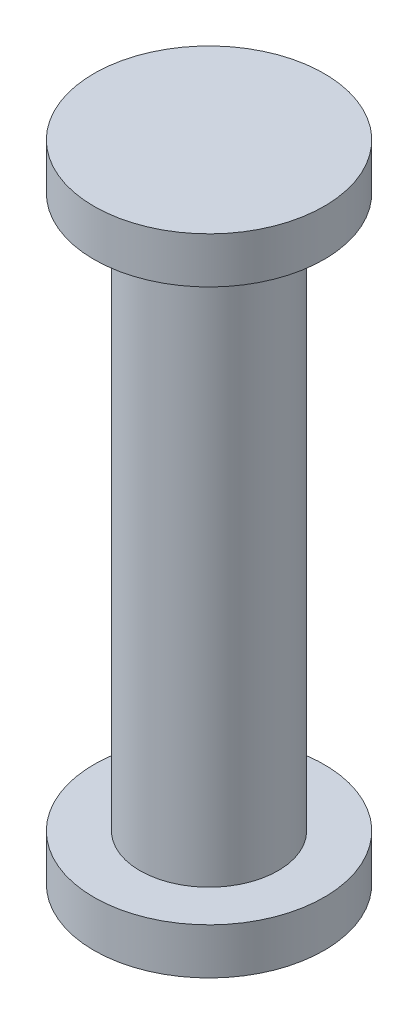
ISO-10303-21;
HEADER;
FILE_DESCRIPTION(('STEP AP214'),'2;1');
FILE_NAME('part.step','',(''),(''),'','','');
FILE_SCHEMA(('AUTOMOTIVE_DESIGN { 1 0 10303 214 1 1 1 1 }'));
ENDSEC;
DATA;
#1=APPLICATION_CONTEXT('core data for automotive mechanical design processes');
#2=APPLICATION_PROTOCOL_DEFINITION('international standard','automotive_design',2000,#1);
#3=PRODUCT_CONTEXT('',#1,'mechanical');
#4=PRODUCT('Part','Part','',(#3));
#5=PRODUCT_RELATED_PRODUCT_CATEGORY('part','',(#4));
#6=PRODUCT_DEFINITION_FORMATION('','',#4);
#7=PRODUCT_DEFINITION_CONTEXT('part definition',#1,'design');
#8=PRODUCT_DEFINITION('design','',#6,#7);
#9=PRODUCT_DEFINITION_SHAPE('','',#8);
#10=(LENGTH_UNIT() NAMED_UNIT(*) SI_UNIT(.MILLI.,.METRE.));
#11=(NAMED_UNIT(*) PLANE_ANGLE_UNIT() SI_UNIT($,.RADIAN.));
#12=(NAMED_UNIT(*) SI_UNIT($,.STERADIAN.) SOLID_ANGLE_UNIT());
#13=UNCERTAINTY_MEASURE_WITH_UNIT(LENGTH_MEASURE(1.E-05),#10,'distance_accuracy_value','');
#14=(GEOMETRIC_REPRESENTATION_CONTEXT(3) GLOBAL_UNCERTAINTY_ASSIGNED_CONTEXT((#13)) GLOBAL_UNIT_ASSIGNED_CONTEXT((#10,
#11,#12)) REPRESENTATION_CONTEXT('',''));
#15=CARTESIAN_POINT('',(0.,0.,0.));
#16=DIRECTION('',(0.,0.,1.));
#17=DIRECTION('',(1.,0.,0.));
#18=AXIS2_PLACEMENT_3D('',#15,#16,#17);
#19=CARTESIAN_POINT('',(0.,1.,0.));
#20=DIRECTION('',(0.,-1.,0.));
#21=DIRECTION('',(0.,0.,-1.));
#22=AXIS2_PLACEMENT_3D('',#19,#20,#21);
#23=CYLINDRICAL_SURFACE('',#22,2.5);
#24=CARTESIAN_POINT('',(0.,1.,0.));
#25=DIRECTION('',(0.,1.,0.));
#26=DIRECTION('',(0.,0.,1.));
#27=AXIS2_PLACEMENT_3D('',#24,#25,#26);
#28=CIRCLE('',#27,2.5);
#29=CARTESIAN_POINT('',(0.,1.,2.5));
#30=VERTEX_POINT('',#29);
#31=EDGE_CURVE('E41',#30,#30,#28,.T.);
#32=ORIENTED_EDGE('',*,*,#31,.F.);
#33=EDGE_LOOP('',(#32));
#34=FACE_BOUND('',#33,.T.);
#35=CARTESIAN_POINT('',(0.,0.,0.));
#36=DIRECTION('',(0.,1.,0.));
#37=DIRECTION('',(0.,0.,1.));
#38=AXIS2_PLACEMENT_3D('',#35,#36,#37);
#39=CIRCLE('',#38,2.5);
#40=CARTESIAN_POINT('',(0.,0.,2.5));
#41=VERTEX_POINT('',#40);
#42=EDGE_CURVE('E37',#41,#41,#39,.T.);
#43=ORIENTED_EDGE('',*,*,#42,.T.);
#44=EDGE_LOOP('',(#43));
#45=FACE_BOUND('',#44,.T.);
#46=ADVANCED_FACE('F34',(#34,#45),#23,.T.);
#47=CARTESIAN_POINT('',(0.,1.,0.));
#48=DIRECTION('',(0.,1.,0.));
#49=DIRECTION('',(0.,0.,1.));
#50=AXIS2_PLACEMENT_3D('',#47,#48,#49);
#51=PLANE('',#50);
#52=CARTESIAN_POINT('',(0.,1.,0.));
#53=DIRECTION('',(0.,1.,0.));
#54=DIRECTION('',(0.,0.,1.));
#55=AXIS2_PLACEMENT_3D('',#52,#53,#54);
#56=CIRCLE('',#55,1.5);
#57=CARTESIAN_POINT('',(0.,1.,1.5));
#58=VERTEX_POINT('',#57);
#59=EDGE_CURVE('E10',#58,#58,#56,.T.);
#60=ORIENTED_EDGE('',*,*,#59,.F.);
#61=EDGE_LOOP('',(#60));
#62=FACE_BOUND('',#61,.T.);
#63=ORIENTED_EDGE('',*,*,#31,.T.);
#64=EDGE_LOOP('',(#63));
#65=FACE_BOUND('',#64,.T.);
#66=ADVANCED_FACE('F75',(#62,#65),#51,.T.);
#67=CARTESIAN_POINT('',(0.,0.,0.));
#68=DIRECTION('',(0.,1.,0.));
#69=DIRECTION('',(0.,0.,1.));
#70=AXIS2_PLACEMENT_3D('',#67,#68,#69);
#71=PLANE('',#70);
#72=ORIENTED_EDGE('',*,*,#42,.F.);
#73=EDGE_LOOP('',(#72));
#74=FACE_BOUND('',#73,.T.);
#75=ADVANCED_FACE('F80',(#74),#71,.F.);
#76=CARTESIAN_POINT('',(0.,13.,0.));
#77=DIRECTION('',(0.,-1.,0.));
#78=DIRECTION('',(0.,0.,-1.));
#79=AXIS2_PLACEMENT_3D('',#76,#77,#78);
#80=CYLINDRICAL_SURFACE('',#79,1.5);
#81=CARTESIAN_POINT('',(0.,13.,0.));
#82=DIRECTION('',(0.,1.,0.));
#83=DIRECTION('',(0.,0.,1.));
#84=AXIS2_PLACEMENT_3D('',#81,#82,#83);
#85=CIRCLE('',#84,1.5);
#86=CARTESIAN_POINT('',(0.,13.,1.5));
#87=VERTEX_POINT('',#86);
#88=EDGE_CURVE('E47',#87,#87,#85,.T.);
#89=ORIENTED_EDGE('',*,*,#88,.F.);
#90=EDGE_LOOP('',(#89));
#91=FACE_BOUND('',#90,.T.);
#92=ORIENTED_EDGE('',*,*,#59,.T.);
#93=EDGE_LOOP('',(#92));
#94=FACE_BOUND('',#93,.T.);
#95=ADVANCED_FACE('F62',(#91,#94),#80,.T.);
#96=CARTESIAN_POINT('',(0.,14.,0.));
#97=DIRECTION('',(0.,-1.,0.));
#98=DIRECTION('',(0.,0.,-1.));
#99=AXIS2_PLACEMENT_3D('',#96,#97,#98);
#100=CYLINDRICAL_SURFACE('',#99,2.5);
#101=CARTESIAN_POINT('',(0.,14.,0.));
#102=DIRECTION('',(0.,1.,0.));
#103=DIRECTION('',(0.,0.,1.));
#104=AXIS2_PLACEMENT_3D('',#101,#102,#103);
#105=CIRCLE('',#104,2.5);
#106=CARTESIAN_POINT('',(0.,14.,2.5));
#107=VERTEX_POINT('',#106);
#108=EDGE_CURVE('E50',#107,#107,#105,.T.);
#109=ORIENTED_EDGE('',*,*,#108,.F.);
#110=EDGE_LOOP('',(#109));
#111=FACE_BOUND('',#110,.T.);
#112=CARTESIAN_POINT('',(0.,13.,0.));
#113=DIRECTION('',(0.,1.,0.));
#114=DIRECTION('',(0.,0.,1.));
#115=AXIS2_PLACEMENT_3D('',#112,#113,#114);
#116=CIRCLE('',#115,2.5);
#117=CARTESIAN_POINT('',(0.,13.,2.5));
#118=VERTEX_POINT('',#117);
#119=EDGE_CURVE('E51',#118,#118,#116,.T.);
#120=ORIENTED_EDGE('',*,*,#119,.T.);
#121=EDGE_LOOP('',(#120));
#122=FACE_BOUND('',#121,.T.);
#123=ADVANCED_FACE('F59',(#111,#122),#100,.T.);
#124=CARTESIAN_POINT('',(0.,14.,0.));
#125=DIRECTION('',(0.,1.,0.));
#126=DIRECTION('',(0.,0.,1.));
#127=AXIS2_PLACEMENT_3D('',#124,#125,#126);
#128=PLANE('',#127);
#129=ORIENTED_EDGE('',*,*,#108,.T.);
#130=EDGE_LOOP('',(#129));
#131=FACE_BOUND('',#130,.T.);
#132=ADVANCED_FACE('F57',(#131),#128,.T.);
#133=CARTESIAN_POINT('',(0.,13.,0.));
#134=DIRECTION('',(0.,1.,0.));
#135=DIRECTION('',(0.,0.,1.));
#136=AXIS2_PLACEMENT_3D('',#133,#134,#135);
#137=PLANE('',#136);
#138=ORIENTED_EDGE('',*,*,#88,.T.);
#139=EDGE_LOOP('',(#138));
#140=FACE_BOUND('',#139,.T.);
#141=ORIENTED_EDGE('',*,*,#119,.F.);
#142=EDGE_LOOP('',(#141));
#143=FACE_BOUND('',#142,.T.);
#144=ADVANCED_FACE('F66',(#140,#143),#137,.F.);
#145=CLOSED_SHELL('',(#46,#66,#75,#95,#123,#132,#144));
#146=MANIFOLD_SOLID_BREP('B2',#145);
#147=ADVANCED_BREP_SHAPE_REPRESENTATION('',(#18,#146),#14);
#148=SHAPE_DEFINITION_REPRESENTATION(#9,#147);
ENDSEC;
END-ISO-10303-21;
